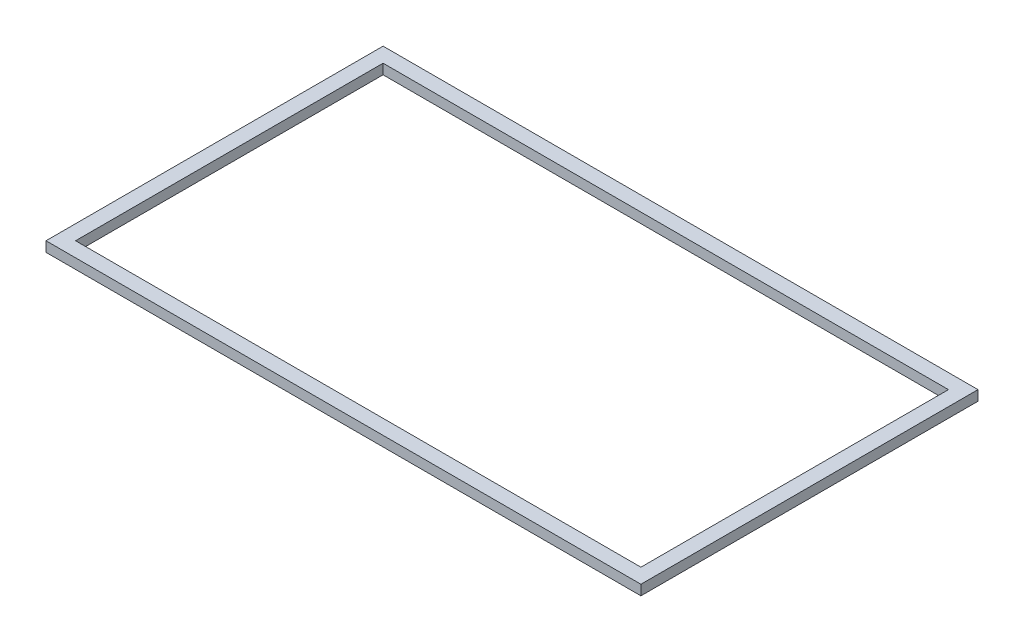
ISO-10303-21;
HEADER;
FILE_DESCRIPTION(('STEP AP214'),'2;1');
FILE_NAME('part.step','',(''),(''),'','','');
FILE_SCHEMA(('AUTOMOTIVE_DESIGN { 1 0 10303 214 1 1 1 1 }'));
ENDSEC;
DATA;
#1=APPLICATION_CONTEXT('core data for automotive mechanical design processes');
#2=APPLICATION_PROTOCOL_DEFINITION('international standard','automotive_design',2000,#1);
#3=PRODUCT_CONTEXT('',#1,'mechanical');
#4=PRODUCT('Part','Part','',(#3));
#5=PRODUCT_RELATED_PRODUCT_CATEGORY('part','',(#4));
#6=PRODUCT_DEFINITION_FORMATION('','',#4);
#7=PRODUCT_DEFINITION_CONTEXT('part definition',#1,'design');
#8=PRODUCT_DEFINITION('design','',#6,#7);
#9=PRODUCT_DEFINITION_SHAPE('','',#8);
#10=(LENGTH_UNIT() NAMED_UNIT(*) SI_UNIT(.MILLI.,.METRE.));
#11=(NAMED_UNIT(*) PLANE_ANGLE_UNIT() SI_UNIT($,.RADIAN.));
#12=(NAMED_UNIT(*) SI_UNIT($,.STERADIAN.) SOLID_ANGLE_UNIT());
#13=UNCERTAINTY_MEASURE_WITH_UNIT(LENGTH_MEASURE(1.E-05),#10,'distance_accuracy_value','');
#14=(GEOMETRIC_REPRESENTATION_CONTEXT(3) GLOBAL_UNCERTAINTY_ASSIGNED_CONTEXT((#13)) GLOBAL_UNIT_ASSIGNED_CONTEXT((#10,
#11,#12)) REPRESENTATION_CONTEXT('',''));
#15=CARTESIAN_POINT('',(0.,0.,0.));
#16=DIRECTION('',(0.,0.,1.));
#17=DIRECTION('',(1.,0.,0.));
#18=AXIS2_PLACEMENT_3D('',#15,#16,#17);
#19=CARTESIAN_POINT('',(0.,1.5,0.));
#20=DIRECTION('',(0.,-1.,0.));
#21=DIRECTION('',(0.,0.,-1.));
#22=AXIS2_PLACEMENT_3D('',#19,#20,#21);
#23=PLANE('',#22);
#24=DIRECTION('',(0.,0.,-1.));
#25=VECTOR('',#24,1.);
#26=CARTESIAN_POINT('',(44.3,1.5,25.1));
#27=LINE('',#26,#25);
#28=CARTESIAN_POINT('',(44.3,1.5,25.1));
#29=VERTEX_POINT('',#28);
#30=CARTESIAN_POINT('',(44.3,1.5,-25.1));
#31=VERTEX_POINT('',#30);
#32=EDGE_CURVE('E153',#29,#31,#27,.T.);
#33=ORIENTED_EDGE('',*,*,#32,.T.);
#34=DIRECTION('',(-1.,0.,0.));
#35=VECTOR('',#34,1.);
#36=CARTESIAN_POINT('',(-44.3,1.5,-25.1));
#37=LINE('',#36,#35);
#38=CARTESIAN_POINT('',(-44.3,1.5,-25.1));
#39=VERTEX_POINT('',#38);
#40=EDGE_CURVE('E157',#31,#39,#37,.T.);
#41=ORIENTED_EDGE('',*,*,#40,.T.);
#42=DIRECTION('',(0.,0.,1.));
#43=VECTOR('',#42,1.);
#44=CARTESIAN_POINT('',(-44.3,1.5,25.1));
#45=LINE('',#44,#43);
#46=CARTESIAN_POINT('',(-44.3,1.5,25.1));
#47=VERTEX_POINT('',#46);
#48=EDGE_CURVE('E161',#39,#47,#45,.T.);
#49=ORIENTED_EDGE('',*,*,#48,.T.);
#50=DIRECTION('',(1.,0.,0.));
#51=VECTOR('',#50,1.);
#52=CARTESIAN_POINT('',(-44.3,1.5,25.1));
#53=LINE('',#52,#51);
#54=EDGE_CURVE('E164',#47,#29,#53,.T.);
#55=ORIENTED_EDGE('',*,*,#54,.T.);
#56=EDGE_LOOP('',(#33,#41,#49,#55));
#57=FACE_BOUND('',#56,.T.);
#58=DIRECTION('',(0.,0.,-1.));
#59=VECTOR('',#58,1.);
#60=CARTESIAN_POINT('',(42.1,1.5,22.9));
#61=LINE('',#60,#59);
#62=CARTESIAN_POINT('',(42.1,1.5,22.9));
#63=VERTEX_POINT('',#62);
#64=CARTESIAN_POINT('',(42.1,1.5,-22.9));
#65=VERTEX_POINT('',#64);
#66=EDGE_CURVE('E105',#63,#65,#61,.T.);
#67=ORIENTED_EDGE('',*,*,#66,.F.);
#68=DIRECTION('',(1.,0.,0.));
#69=VECTOR('',#68,1.);
#70=CARTESIAN_POINT('',(-42.1,1.5,22.9));
#71=LINE('',#70,#69);
#72=CARTESIAN_POINT('',(-42.1,1.5,22.9));
#73=VERTEX_POINT('',#72);
#74=EDGE_CURVE('E131',#73,#63,#71,.T.);
#75=ORIENTED_EDGE('',*,*,#74,.F.);
#76=DIRECTION('',(0.,0.,1.));
#77=VECTOR('',#76,1.);
#78=CARTESIAN_POINT('',(-42.1,1.5,22.9));
#79=LINE('',#78,#77);
#80=CARTESIAN_POINT('',(-42.1,1.5,-22.9));
#81=VERTEX_POINT('',#80);
#82=EDGE_CURVE('E127',#81,#73,#79,.T.);
#83=ORIENTED_EDGE('',*,*,#82,.F.);
#84=DIRECTION('',(-1.,0.,0.));
#85=VECTOR('',#84,1.);
#86=CARTESIAN_POINT('',(-42.1,1.5,-22.9));
#87=LINE('',#86,#85);
#88=EDGE_CURVE('E114',#65,#81,#87,.T.);
#89=ORIENTED_EDGE('',*,*,#88,.F.);
#90=EDGE_LOOP('',(#67,#75,#83,#89));
#91=FACE_BOUND('',#90,.T.);
#92=ADVANCED_FACE('F39',(#57,#91),#23,.F.);
#93=CARTESIAN_POINT('',(0.,0.,0.));
#94=DIRECTION('',(0.,-1.,0.));
#95=DIRECTION('',(0.,0.,-1.));
#96=AXIS2_PLACEMENT_3D('',#93,#94,#95);
#97=PLANE('',#96);
#98=DIRECTION('',(0.,0.,-1.));
#99=VECTOR('',#98,1.);
#100=CARTESIAN_POINT('',(44.3,0.,25.1));
#101=LINE('',#100,#99);
#102=CARTESIAN_POINT('',(44.3,0.,25.1));
#103=VERTEX_POINT('',#102);
#104=CARTESIAN_POINT('',(44.3,0.,-25.1));
#105=VERTEX_POINT('',#104);
#106=EDGE_CURVE('E123',#103,#105,#101,.T.);
#107=ORIENTED_EDGE('',*,*,#106,.F.);
#108=DIRECTION('',(1.,0.,0.));
#109=VECTOR('',#108,1.);
#110=CARTESIAN_POINT('',(-44.3,0.,25.1));
#111=LINE('',#110,#109);
#112=CARTESIAN_POINT('',(-44.3,0.,25.1));
#113=VERTEX_POINT('',#112);
#114=EDGE_CURVE('E158',#113,#103,#111,.T.);
#115=ORIENTED_EDGE('',*,*,#114,.F.);
#116=DIRECTION('',(0.,0.,1.));
#117=VECTOR('',#116,1.);
#118=CARTESIAN_POINT('',(-44.3,0.,25.1));
#119=LINE('',#118,#117);
#120=CARTESIAN_POINT('',(-44.3,0.,-25.1));
#121=VERTEX_POINT('',#120);
#122=EDGE_CURVE('E174',#121,#113,#119,.T.);
#123=ORIENTED_EDGE('',*,*,#122,.F.);
#124=DIRECTION('',(-1.,0.,0.));
#125=VECTOR('',#124,1.);
#126=CARTESIAN_POINT('',(-44.3,0.,-25.1));
#127=LINE('',#126,#125);
#128=EDGE_CURVE('E171',#105,#121,#127,.T.);
#129=ORIENTED_EDGE('',*,*,#128,.F.);
#130=EDGE_LOOP('',(#107,#115,#123,#129));
#131=FACE_BOUND('',#130,.T.);
#132=DIRECTION('',(1.,0.,0.));
#133=VECTOR('',#132,1.);
#134=CARTESIAN_POINT('',(-42.1,0.,22.9));
#135=LINE('',#134,#133);
#136=CARTESIAN_POINT('',(-42.1,0.,22.9));
#137=VERTEX_POINT('',#136);
#138=CARTESIAN_POINT('',(42.1,0.,22.9));
#139=VERTEX_POINT('',#138);
#140=EDGE_CURVE('E115',#137,#139,#135,.T.);
#141=ORIENTED_EDGE('',*,*,#140,.T.);
#142=DIRECTION('',(0.,0.,-1.));
#143=VECTOR('',#142,1.);
#144=CARTESIAN_POINT('',(42.1,0.,22.9));
#145=LINE('',#144,#143);
#146=CARTESIAN_POINT('',(42.1,0.,-22.9));
#147=VERTEX_POINT('',#146);
#148=EDGE_CURVE('E63',#139,#147,#145,.T.);
#149=ORIENTED_EDGE('',*,*,#148,.T.);
#150=DIRECTION('',(-1.,0.,0.));
#151=VECTOR('',#150,1.);
#152=CARTESIAN_POINT('',(-42.1,0.,-22.9));
#153=LINE('',#152,#151);
#154=CARTESIAN_POINT('',(-42.1,0.,-22.9));
#155=VERTEX_POINT('',#154);
#156=EDGE_CURVE('E121',#147,#155,#153,.T.);
#157=ORIENTED_EDGE('',*,*,#156,.T.);
#158=DIRECTION('',(0.,0.,1.));
#159=VECTOR('',#158,1.);
#160=CARTESIAN_POINT('',(-42.1,0.,22.9));
#161=LINE('',#160,#159);
#162=EDGE_CURVE('E140',#155,#137,#161,.T.);
#163=ORIENTED_EDGE('',*,*,#162,.T.);
#164=EDGE_LOOP('',(#141,#149,#157,#163));
#165=FACE_BOUND('',#164,.T.);
#166=ADVANCED_FACE('F197',(#131,#165),#97,.T.);
#167=CARTESIAN_POINT('',(44.3,1.5,25.1));
#168=DIRECTION('',(-1.,0.,0.));
#169=DIRECTION('',(0.,0.,1.));
#170=AXIS2_PLACEMENT_3D('',#167,#168,#169);
#171=PLANE('',#170);
#172=ORIENTED_EDGE('',*,*,#106,.T.);
#173=DIRECTION('',(0.,-1.,0.));
#174=VECTOR('',#173,1.);
#175=CARTESIAN_POINT('',(44.3,1.5,-25.1));
#176=LINE('',#175,#174);
#177=EDGE_CURVE('E11',#31,#105,#176,.T.);
#178=ORIENTED_EDGE('',*,*,#177,.F.);
#179=ORIENTED_EDGE('',*,*,#32,.F.);
#180=DIRECTION('',(0.,-1.,0.));
#181=VECTOR('',#180,1.);
#182=CARTESIAN_POINT('',(44.3,1.5,25.1));
#183=LINE('',#182,#181);
#184=EDGE_CURVE('E167',#29,#103,#183,.T.);
#185=ORIENTED_EDGE('',*,*,#184,.T.);
#186=EDGE_LOOP('',(#172,#178,#179,#185));
#187=FACE_BOUND('',#186,.T.);
#188=ADVANCED_FACE('F41',(#187),#171,.F.);
#189=CARTESIAN_POINT('',(-44.3,1.5,-25.1));
#190=DIRECTION('',(0.,0.,1.));
#191=DIRECTION('',(1.,0.,0.));
#192=AXIS2_PLACEMENT_3D('',#189,#190,#191);
#193=PLANE('',#192);
#194=ORIENTED_EDGE('',*,*,#128,.T.);
#195=DIRECTION('',(0.,-1.,0.));
#196=VECTOR('',#195,1.);
#197=CARTESIAN_POINT('',(-44.3,1.5,-25.1));
#198=LINE('',#197,#196);
#199=EDGE_CURVE('E48',#39,#121,#198,.T.);
#200=ORIENTED_EDGE('',*,*,#199,.F.);
#201=ORIENTED_EDGE('',*,*,#40,.F.);
#202=ORIENTED_EDGE('',*,*,#177,.T.);
#203=EDGE_LOOP('',(#194,#200,#201,#202));
#204=FACE_BOUND('',#203,.T.);
#205=ADVANCED_FACE('F207',(#204),#193,.F.);
#206=CARTESIAN_POINT('',(-44.3,1.5,25.1));
#207=DIRECTION('',(1.,0.,0.));
#208=DIRECTION('',(0.,0.,-1.));
#209=AXIS2_PLACEMENT_3D('',#206,#207,#208);
#210=PLANE('',#209);
#211=ORIENTED_EDGE('',*,*,#122,.T.);
#212=DIRECTION('',(0.,-1.,0.));
#213=VECTOR('',#212,1.);
#214=CARTESIAN_POINT('',(-44.3,1.5,25.1));
#215=LINE('',#214,#213);
#216=EDGE_CURVE('E182',#47,#113,#215,.T.);
#217=ORIENTED_EDGE('',*,*,#216,.F.);
#218=ORIENTED_EDGE('',*,*,#48,.F.);
#219=ORIENTED_EDGE('',*,*,#199,.T.);
#220=EDGE_LOOP('',(#211,#217,#218,#219));
#221=FACE_BOUND('',#220,.T.);
#222=ADVANCED_FACE('F191',(#221),#210,.F.);
#223=CARTESIAN_POINT('',(-44.3,1.5,25.1));
#224=DIRECTION('',(0.,0.,-1.));
#225=DIRECTION('',(-1.,0.,0.));
#226=AXIS2_PLACEMENT_3D('',#223,#224,#225);
#227=PLANE('',#226);
#228=ORIENTED_EDGE('',*,*,#114,.T.);
#229=ORIENTED_EDGE('',*,*,#184,.F.);
#230=ORIENTED_EDGE('',*,*,#54,.F.);
#231=ORIENTED_EDGE('',*,*,#216,.T.);
#232=EDGE_LOOP('',(#228,#229,#230,#231));
#233=FACE_BOUND('',#232,.T.);
#234=ADVANCED_FACE('F201',(#233),#227,.F.);
#235=CARTESIAN_POINT('',(42.1,1.5,22.9));
#236=DIRECTION('',(-1.,0.,0.));
#237=DIRECTION('',(0.,0.,1.));
#238=AXIS2_PLACEMENT_3D('',#235,#236,#237);
#239=PLANE('',#238);
#240=ORIENTED_EDGE('',*,*,#148,.F.);
#241=DIRECTION('',(0.,-1.,0.));
#242=VECTOR('',#241,1.);
#243=CARTESIAN_POINT('',(42.1,1.5,22.9));
#244=LINE('',#243,#242);
#245=EDGE_CURVE('E109',#63,#139,#244,.T.);
#246=ORIENTED_EDGE('',*,*,#245,.F.);
#247=ORIENTED_EDGE('',*,*,#66,.T.);
#248=DIRECTION('',(0.,-1.,0.));
#249=VECTOR('',#248,1.);
#250=CARTESIAN_POINT('',(42.1,1.5,-22.9));
#251=LINE('',#250,#249);
#252=EDGE_CURVE('E108',#65,#147,#251,.T.);
#253=ORIENTED_EDGE('',*,*,#252,.T.);
#254=EDGE_LOOP('',(#240,#246,#247,#253));
#255=FACE_BOUND('',#254,.T.);
#256=ADVANCED_FACE('F107',(#255),#239,.T.);
#257=CARTESIAN_POINT('',(-42.1,1.5,-22.9));
#258=DIRECTION('',(0.,0.,1.));
#259=DIRECTION('',(1.,0.,0.));
#260=AXIS2_PLACEMENT_3D('',#257,#258,#259);
#261=PLANE('',#260);
#262=ORIENTED_EDGE('',*,*,#156,.F.);
#263=ORIENTED_EDGE('',*,*,#252,.F.);
#264=ORIENTED_EDGE('',*,*,#88,.T.);
#265=DIRECTION('',(0.,-1.,0.));
#266=VECTOR('',#265,1.);
#267=CARTESIAN_POINT('',(-42.1,1.5,-22.9));
#268=LINE('',#267,#266);
#269=EDGE_CURVE('E124',#81,#155,#268,.T.);
#270=ORIENTED_EDGE('',*,*,#269,.T.);
#271=EDGE_LOOP('',(#262,#263,#264,#270));
#272=FACE_BOUND('',#271,.T.);
#273=ADVANCED_FACE('F118',(#272),#261,.T.);
#274=CARTESIAN_POINT('',(-42.1,1.5,22.9));
#275=DIRECTION('',(1.,0.,0.));
#276=DIRECTION('',(0.,0.,-1.));
#277=AXIS2_PLACEMENT_3D('',#274,#275,#276);
#278=PLANE('',#277);
#279=ORIENTED_EDGE('',*,*,#162,.F.);
#280=ORIENTED_EDGE('',*,*,#269,.F.);
#281=ORIENTED_EDGE('',*,*,#82,.T.);
#282=DIRECTION('',(0.,-1.,0.));
#283=VECTOR('',#282,1.);
#284=CARTESIAN_POINT('',(-42.1,1.5,22.9));
#285=LINE('',#284,#283);
#286=EDGE_CURVE('E55',#73,#137,#285,.T.);
#287=ORIENTED_EDGE('',*,*,#286,.T.);
#288=EDGE_LOOP('',(#279,#280,#281,#287));
#289=FACE_BOUND('',#288,.T.);
#290=ADVANCED_FACE('F230',(#289),#278,.T.);
#291=CARTESIAN_POINT('',(-42.1,1.5,22.9));
#292=DIRECTION('',(0.,0.,-1.));
#293=DIRECTION('',(-1.,0.,0.));
#294=AXIS2_PLACEMENT_3D('',#291,#292,#293);
#295=PLANE('',#294);
#296=ORIENTED_EDGE('',*,*,#140,.F.);
#297=ORIENTED_EDGE('',*,*,#286,.F.);
#298=ORIENTED_EDGE('',*,*,#74,.T.);
#299=ORIENTED_EDGE('',*,*,#245,.T.);
#300=EDGE_LOOP('',(#296,#297,#298,#299));
#301=FACE_BOUND('',#300,.T.);
#302=ADVANCED_FACE('F234',(#301),#295,.T.);
#303=CLOSED_SHELL('',(#92,#166,#188,#205,#222,#234,#256,#273,#290,#302));
#304=MANIFOLD_SOLID_BREP('B2',#303);
#305=ADVANCED_BREP_SHAPE_REPRESENTATION('',(#18,#304),#14);
#306=SHAPE_DEFINITION_REPRESENTATION(#9,#305);
ENDSEC;
END-ISO-10303-21;
